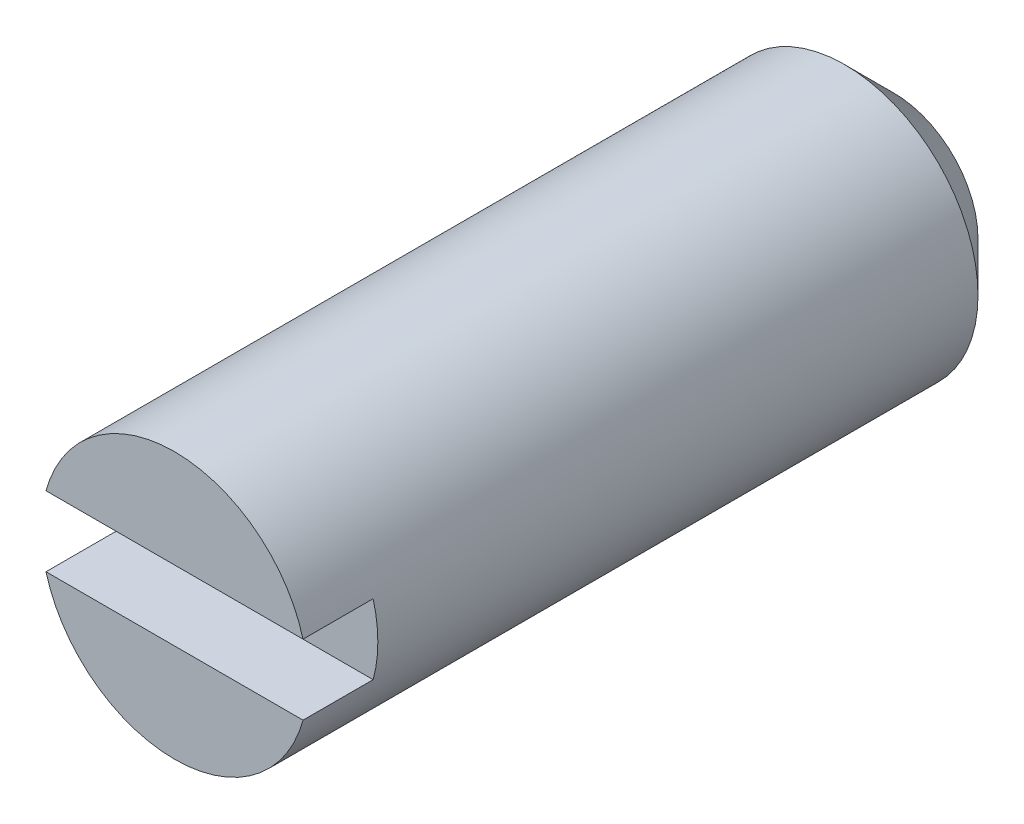
ISO-10303-21;
HEADER;
FILE_DESCRIPTION(('STEP AP214'),'2;1');
FILE_NAME('part.step','',(''),(''),'','','');
FILE_SCHEMA(('AUTOMOTIVE_DESIGN { 1 0 10303 214 1 1 1 1 }'));
ENDSEC;
DATA;
#1=APPLICATION_CONTEXT('core data for automotive mechanical design processes');
#2=APPLICATION_PROTOCOL_DEFINITION('international standard','automotive_design',2000,#1);
#3=PRODUCT_CONTEXT('',#1,'mechanical');
#4=PRODUCT('Part','Part','',(#3));
#5=PRODUCT_RELATED_PRODUCT_CATEGORY('part','',(#4));
#6=PRODUCT_DEFINITION_FORMATION('','',#4);
#7=PRODUCT_DEFINITION_CONTEXT('part definition',#1,'design');
#8=PRODUCT_DEFINITION('design','',#6,#7);
#9=PRODUCT_DEFINITION_SHAPE('','',#8);
#10=(LENGTH_UNIT() NAMED_UNIT(*) SI_UNIT(.MILLI.,.METRE.));
#11=(NAMED_UNIT(*) PLANE_ANGLE_UNIT() SI_UNIT($,.RADIAN.));
#12=(NAMED_UNIT(*) SI_UNIT($,.STERADIAN.) SOLID_ANGLE_UNIT());
#13=UNCERTAINTY_MEASURE_WITH_UNIT(LENGTH_MEASURE(1.E-05),#10,'distance_accuracy_value','');
#14=(GEOMETRIC_REPRESENTATION_CONTEXT(3) GLOBAL_UNCERTAINTY_ASSIGNED_CONTEXT((#13)) GLOBAL_UNIT_ASSIGNED_CONTEXT((#10,
#11,#12)) REPRESENTATION_CONTEXT('',''));
#15=CARTESIAN_POINT('',(0.,0.,0.));
#16=DIRECTION('',(0.,0.,1.));
#17=DIRECTION('',(1.,0.,0.));
#18=AXIS2_PLACEMENT_3D('',#15,#16,#17);
#19=CARTESIAN_POINT('',(6.34999999999999,-2.22188070717714E-13,13.0302));
#20=DIRECTION('',(0.,0.,1.));
#21=DIRECTION('',(1.,0.,0.));
#22=AXIS2_PLACEMENT_3D('',#19,#20,#21);
#23=PLANE('',#22);
#24=DIRECTION('',(-1.,0.,0.));
#25=VECTOR('',#24,1.);
#26=CARTESIAN_POINT('',(6.34999999999999,0.634999999999778,13.0302));
#27=LINE('',#26,#25);
#28=CARTESIAN_POINT('',(8.67794845303756,0.634999999999778,13.0302));
#29=VERTEX_POINT('',#28);
#30=CARTESIAN_POINT('',(4.02205154696243,0.634999999999778,13.0302));
#31=VERTEX_POINT('',#30);
#32=EDGE_CURVE('E78',#29,#31,#27,.T.);
#33=ORIENTED_EDGE('',*,*,#32,.F.);
#34=CARTESIAN_POINT('',(6.34999999999999,-2.22188070717714E-13,13.0302));
#35=DIRECTION('',(0.,0.,1.));
#36=DIRECTION('',(1.,0.,0.));
#37=AXIS2_PLACEMENT_3D('',#34,#35,#36);
#38=CIRCLE('',#37,2.413);
#39=EDGE_CURVE('E89',#29,#31,#38,.T.);
#40=ORIENTED_EDGE('',*,*,#39,.T.);
#41=EDGE_LOOP('',(#33,#40));
#42=FACE_BOUND('',#41,.T.);
#43=ADVANCED_FACE('F32',(#42),#23,.T.);
#44=CARTESIAN_POINT('',(6.34999999999999,-2.22188070717714E-13,13.0302));
#45=DIRECTION('',(0.,0.,-1.));
#46=DIRECTION('',(-1.,0.,0.));
#47=AXIS2_PLACEMENT_3D('',#44,#45,#46);
#48=CYLINDRICAL_SURFACE('',#47,2.413);
#49=CARTESIAN_POINT('',(6.34999999999999,-2.22188070717714E-13,11.7602));
#50=DIRECTION('',(0.,0.,1.));
#51=DIRECTION('',(1.,0.,0.));
#52=AXIS2_PLACEMENT_3D('',#49,#50,#51);
#53=CIRCLE('',#52,2.413);
#54=CARTESIAN_POINT('',(4.02205154696243,0.634999999999778,11.7602));
#55=VERTEX_POINT('',#54);
#56=CARTESIAN_POINT('',(4.02205154696243,-0.635000000000222,11.7602));
#57=VERTEX_POINT('',#56);
#58=EDGE_CURVE('E11',#55,#57,#53,.T.);
#59=ORIENTED_EDGE('',*,*,#58,.F.);
#60=DIRECTION('',(0.,0.,-1.));
#61=VECTOR('',#60,1.);
#62=CARTESIAN_POINT('',(4.02205154696243,0.634999999999778,13.0302));
#63=LINE('',#62,#61);
#64=EDGE_CURVE('E94',#55,#31,#63,.F.);
#65=ORIENTED_EDGE('',*,*,#64,.T.);
#66=ORIENTED_EDGE('',*,*,#39,.F.);
#67=DIRECTION('',(0.,0.,-1.));
#68=VECTOR('',#67,1.);
#69=CARTESIAN_POINT('',(8.67794845303756,0.634999999999778,13.0302));
#70=LINE('',#69,#68);
#71=CARTESIAN_POINT('',(8.67794845303756,0.634999999999778,11.7602));
#72=VERTEX_POINT('',#71);
#73=EDGE_CURVE('E90',#29,#72,#70,.T.);
#74=ORIENTED_EDGE('',*,*,#73,.T.);
#75=CARTESIAN_POINT('',(8.67794845303756,-0.635000000000222,11.7602));
#76=VERTEX_POINT('',#75);
#77=EDGE_CURVE('E41',#76,#72,#53,.T.);
#78=ORIENTED_EDGE('',*,*,#77,.F.);
#79=DIRECTION('',(0.,0.,-1.));
#80=VECTOR('',#79,1.);
#81=CARTESIAN_POINT('',(8.67794845303756,-0.635000000000222,13.0302));
#82=LINE('',#81,#80);
#83=CARTESIAN_POINT('',(8.67794845303756,-0.635000000000222,13.0302));
#84=VERTEX_POINT('',#83);
#85=EDGE_CURVE('E73',#76,#84,#82,.F.);
#86=ORIENTED_EDGE('',*,*,#85,.T.);
#87=CARTESIAN_POINT('',(4.02205154696243,-0.635000000000222,13.0302));
#88=VERTEX_POINT('',#87);
#89=EDGE_CURVE('E84',#88,#84,#38,.T.);
#90=ORIENTED_EDGE('',*,*,#89,.F.);
#91=DIRECTION('',(0.,0.,-1.));
#92=VECTOR('',#91,1.);
#93=CARTESIAN_POINT('',(4.02205154696243,-0.635000000000222,13.0302));
#94=LINE('',#93,#92);
#95=EDGE_CURVE('E48',#88,#57,#94,.T.);
#96=ORIENTED_EDGE('',*,*,#95,.T.);
#97=EDGE_LOOP('',(#59,#65,#66,#74,#78,#86,#90,#96));
#98=FACE_BOUND('',#97,.T.);
#99=CARTESIAN_POINT('',(6.34999999999999,-2.22188070717714E-13,0.888999999999999));
#100=DIRECTION('',(0.,0.,1.));
#101=DIRECTION('',(1.,0.,0.));
#102=AXIS2_PLACEMENT_3D('',#99,#100,#101);
#103=CIRCLE('',#102,2.413);
#104=CARTESIAN_POINT('',(8.76299999999999,-2.22188070717714E-13,0.888999999999999));
#105=VERTEX_POINT('',#104);
#106=EDGE_CURVE('E93',#105,#105,#103,.T.);
#107=ORIENTED_EDGE('',*,*,#106,.T.);
#108=EDGE_LOOP('',(#107));
#109=FACE_BOUND('',#108,.T.);
#110=ADVANCED_FACE('F82',(#98,#109),#48,.T.);
#111=DIRECTION('',(1.,0.,0.));
#112=VECTOR('',#111,1.);
#113=CARTESIAN_POINT('',(6.34999999999999,-0.635000000000222,13.0302));
#114=LINE('',#113,#112);
#115=EDGE_CURVE('E70',#88,#84,#114,.T.);
#116=ORIENTED_EDGE('',*,*,#115,.F.);
#117=ORIENTED_EDGE('',*,*,#89,.T.);
#118=EDGE_LOOP('',(#116,#117));
#119=FACE_BOUND('',#118,.T.);
#120=ADVANCED_FACE('F88',(#119),#23,.T.);
#121=CARTESIAN_POINT('',(6.34999999999999,-2.22188070717714E-13,0.));
#122=DIRECTION('',(0.,0.,1.));
#123=DIRECTION('',(1.,0.,0.));
#124=AXIS2_PLACEMENT_3D('',#121,#122,#123);
#125=PLANE('',#124);
#126=CARTESIAN_POINT('',(6.34999999999999,0.,0.));
#127=DIRECTION('',(0.,0.,1.));
#128=DIRECTION('',(1.,0.,0.));
#129=AXIS2_PLACEMENT_3D('',#126,#127,#128);
#130=CIRCLE('',#129,1.0549412305906);
#131=CARTESIAN_POINT('',(7.40494123059059,0.,0.));
#132=VERTEX_POINT('',#131);
#133=EDGE_CURVE('E36',#132,#132,#130,.T.);
#134=ORIENTED_EDGE('',*,*,#133,.T.);
#135=EDGE_LOOP('',(#134));
#136=FACE_BOUND('',#135,.T.);
#137=CARTESIAN_POINT('',(6.34999999999999,-2.22188070717714E-13,0.));
#138=DIRECTION('',(0.,0.,1.));
#139=DIRECTION('',(1.,0.,0.));
#140=AXIS2_PLACEMENT_3D('',#137,#138,#139);
#141=CIRCLE('',#140,1.524);
#142=CARTESIAN_POINT('',(7.87399999999999,-2.22188070717714E-13,0.));
#143=VERTEX_POINT('',#142);
#144=EDGE_CURVE('E79',#143,#143,#141,.F.);
#145=ORIENTED_EDGE('',*,*,#144,.T.);
#146=EDGE_LOOP('',(#145));
#147=FACE_BOUND('',#146,.T.);
#148=ADVANCED_FACE('F121',(#136,#147),#125,.F.);
#149=CARTESIAN_POINT('',(6.34999999999999,-2.22188070717714E-13,0.888999999999999));
#150=DIRECTION('',(0.,0.,1.));
#151=DIRECTION('',(1.,0.,0.));
#152=AXIS2_PLACEMENT_3D('',#149,#150,#151);
#153=CONICAL_SURFACE('',#152,2.413,0.785398163397449);
#154=ORIENTED_EDGE('',*,*,#144,.F.);
#155=EDGE_LOOP('',(#154));
#156=FACE_BOUND('',#155,.T.);
#157=ORIENTED_EDGE('',*,*,#106,.F.);
#158=EDGE_LOOP('',(#157));
#159=FACE_BOUND('',#158,.T.);
#160=ADVANCED_FACE('F34',(#156,#159),#153,.T.);
#161=CARTESIAN_POINT('',(3.937,0.634999999999778,11.7602));
#162=DIRECTION('',(0.,0.,1.));
#163=DIRECTION('',(1.,0.,0.));
#164=AXIS2_PLACEMENT_3D('',#161,#162,#163);
#165=PLANE('',#164);
#166=DIRECTION('',(-1.,0.,0.));
#167=VECTOR('',#166,1.);
#168=CARTESIAN_POINT('',(3.937,0.634999999999778,11.7602));
#169=LINE('',#168,#167);
#170=EDGE_CURVE('E86',#72,#55,#169,.T.);
#171=ORIENTED_EDGE('',*,*,#170,.T.);
#172=ORIENTED_EDGE('',*,*,#58,.T.);
#173=DIRECTION('',(1.,0.,0.));
#174=VECTOR('',#173,1.);
#175=CARTESIAN_POINT('',(3.937,-0.635000000000222,11.7602));
#176=LINE('',#175,#174);
#177=EDGE_CURVE('E106',#57,#76,#176,.T.);
#178=ORIENTED_EDGE('',*,*,#177,.T.);
#179=ORIENTED_EDGE('',*,*,#77,.T.);
#180=EDGE_LOOP('',(#171,#172,#178,#179));
#181=FACE_BOUND('',#180,.T.);
#182=ADVANCED_FACE('F105',(#181),#165,.T.);
#183=CARTESIAN_POINT('',(3.937,0.634999999999778,11.7602));
#184=DIRECTION('',(0.,1.,0.));
#185=DIRECTION('',(0.,0.,1.));
#186=AXIS2_PLACEMENT_3D('',#183,#184,#185);
#187=PLANE('',#186);
#188=ORIENTED_EDGE('',*,*,#32,.T.);
#189=ORIENTED_EDGE('',*,*,#64,.F.);
#190=ORIENTED_EDGE('',*,*,#170,.F.);
#191=ORIENTED_EDGE('',*,*,#73,.F.);
#192=EDGE_LOOP('',(#188,#189,#190,#191));
#193=FACE_BOUND('',#192,.T.);
#194=ADVANCED_FACE('F108',(#193),#187,.F.);
#195=CARTESIAN_POINT('',(3.937,-0.635000000000222,11.7602));
#196=DIRECTION('',(0.,-1.,0.));
#197=DIRECTION('',(1.,0.,0.));
#198=AXIS2_PLACEMENT_3D('',#195,#196,#197);
#199=PLANE('',#198);
#200=ORIENTED_EDGE('',*,*,#115,.T.);
#201=ORIENTED_EDGE('',*,*,#85,.F.);
#202=ORIENTED_EDGE('',*,*,#177,.F.);
#203=ORIENTED_EDGE('',*,*,#95,.F.);
#204=EDGE_LOOP('',(#200,#201,#202,#203));
#205=FACE_BOUND('',#204,.T.);
#206=ADVANCED_FACE('F72',(#205),#199,.F.);
#207=CARTESIAN_POINT('',(6.34999999999999,0.,0.5588));
#208=DIRECTION('',(0.,0.,-1.));
#209=DIRECTION('',(1.,0.,0.));
#210=AXIS2_PLACEMENT_3D('',#207,#208,#209);
#211=SPHERICAL_SURFACE('',#210,1.1938);
#212=ORIENTED_EDGE('',*,*,#133,.F.);
#213=EDGE_LOOP('',(#212));
#214=FACE_BOUND('',#213,.T.);
#215=ADVANCED_FACE('F139',(#214),#211,.T.);
#216=CLOSED_SHELL('',(#43,#110,#120,#148,#160,#182,#194,#206,#215));
#217=MANIFOLD_SOLID_BREP('B2',#216);
#218=ADVANCED_BREP_SHAPE_REPRESENTATION('',(#18,#217),#14);
#219=SHAPE_DEFINITION_REPRESENTATION(#9,#218);
ENDSEC;
END-ISO-10303-21;
